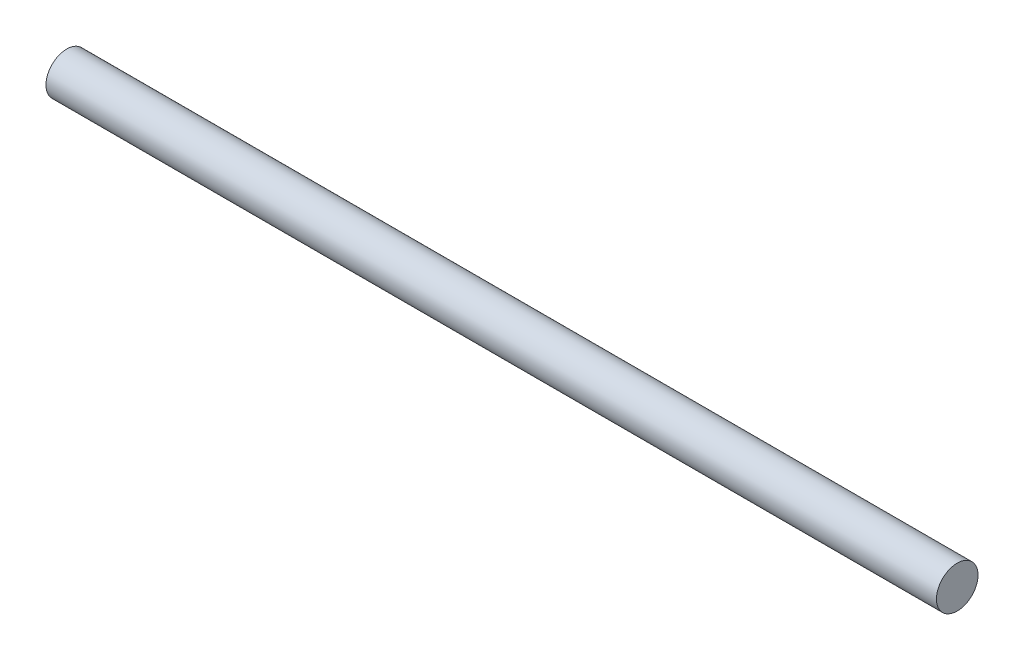
ISO-10303-21;
HEADER;
FILE_DESCRIPTION(('STEP AP214'),'2;1');
FILE_NAME('part.step','',(''),(''),'','','');
FILE_SCHEMA(('AUTOMOTIVE_DESIGN { 1 0 10303 214 1 1 1 1 }'));
ENDSEC;
DATA;
#1=APPLICATION_CONTEXT('core data for automotive mechanical design processes');
#2=APPLICATION_PROTOCOL_DEFINITION('international standard','automotive_design',2000,#1);
#3=PRODUCT_CONTEXT('',#1,'mechanical');
#4=PRODUCT('Part','Part','',(#3));
#5=PRODUCT_RELATED_PRODUCT_CATEGORY('part','',(#4));
#6=PRODUCT_DEFINITION_FORMATION('','',#4);
#7=PRODUCT_DEFINITION_CONTEXT('part definition',#1,'design');
#8=PRODUCT_DEFINITION('design','',#6,#7);
#9=PRODUCT_DEFINITION_SHAPE('','',#8);
#10=(LENGTH_UNIT() NAMED_UNIT(*) SI_UNIT(.MILLI.,.METRE.));
#11=(NAMED_UNIT(*) PLANE_ANGLE_UNIT() SI_UNIT($,.RADIAN.));
#12=(NAMED_UNIT(*) SI_UNIT($,.STERADIAN.) SOLID_ANGLE_UNIT());
#13=UNCERTAINTY_MEASURE_WITH_UNIT(LENGTH_MEASURE(1.E-05),#10,'distance_accuracy_value','');
#14=(GEOMETRIC_REPRESENTATION_CONTEXT(3) GLOBAL_UNCERTAINTY_ASSIGNED_CONTEXT((#13)) GLOBAL_UNIT_ASSIGNED_CONTEXT((#10,
#11,#12)) REPRESENTATION_CONTEXT('',''));
#15=CARTESIAN_POINT('',(0.,0.,0.));
#16=DIRECTION('',(0.,0.,1.));
#17=DIRECTION('',(1.,0.,0.));
#18=AXIS2_PLACEMENT_3D('',#15,#16,#17);
#19=CARTESIAN_POINT('',(600.,0.,0.));
#20=DIRECTION('',(-1.,0.,0.));
#21=DIRECTION('',(0.,0.,1.));
#22=AXIS2_PLACEMENT_3D('',#19,#20,#21);
#23=CYLINDRICAL_SURFACE('',#22,14.);
#24=CARTESIAN_POINT('',(600.,0.,0.));
#25=DIRECTION('',(1.,0.,0.));
#26=DIRECTION('',(0.,0.,-1.));
#27=AXIS2_PLACEMENT_3D('',#24,#25,#26);
#28=CIRCLE('',#27,14.);
#29=CARTESIAN_POINT('',(600.,0.,-14.));
#30=VERTEX_POINT('',#29);
#31=EDGE_CURVE('E10',#30,#30,#28,.T.);
#32=ORIENTED_EDGE('',*,*,#31,.F.);
#33=EDGE_LOOP('',(#32));
#34=FACE_BOUND('',#33,.T.);
#35=CARTESIAN_POINT('',(0.,0.,0.));
#36=DIRECTION('',(1.,0.,0.));
#37=DIRECTION('',(0.,0.,-1.));
#38=AXIS2_PLACEMENT_3D('',#35,#36,#37);
#39=CIRCLE('',#38,14.);
#40=CARTESIAN_POINT('',(0.,0.,-14.));
#41=VERTEX_POINT('',#40);
#42=EDGE_CURVE('E36',#41,#41,#39,.T.);
#43=ORIENTED_EDGE('',*,*,#42,.T.);
#44=EDGE_LOOP('',(#43));
#45=FACE_BOUND('',#44,.T.);
#46=ADVANCED_FACE('F33',(#34,#45),#23,.T.);
#47=CARTESIAN_POINT('',(600.,0.,0.));
#48=DIRECTION('',(1.,0.,0.));
#49=DIRECTION('',(0.,0.,-1.));
#50=AXIS2_PLACEMENT_3D('',#47,#48,#49);
#51=PLANE('',#50);
#52=ORIENTED_EDGE('',*,*,#31,.T.);
#53=EDGE_LOOP('',(#52));
#54=FACE_BOUND('',#53,.T.);
#55=ADVANCED_FACE('F48',(#54),#51,.T.);
#56=CARTESIAN_POINT('',(0.,0.,0.));
#57=DIRECTION('',(1.,0.,0.));
#58=DIRECTION('',(0.,0.,-1.));
#59=AXIS2_PLACEMENT_3D('',#56,#57,#58);
#60=PLANE('',#59);
#61=ORIENTED_EDGE('',*,*,#42,.F.);
#62=EDGE_LOOP('',(#61));
#63=FACE_BOUND('',#62,.T.);
#64=ADVANCED_FACE('F46',(#63),#60,.F.);
#65=CLOSED_SHELL('',(#46,#55,#64));
#66=MANIFOLD_SOLID_BREP('B2',#65);
#67=ADVANCED_BREP_SHAPE_REPRESENTATION('',(#18,#66),#14);
#68=SHAPE_DEFINITION_REPRESENTATION(#9,#67);
ENDSEC;
END-ISO-10303-21;
